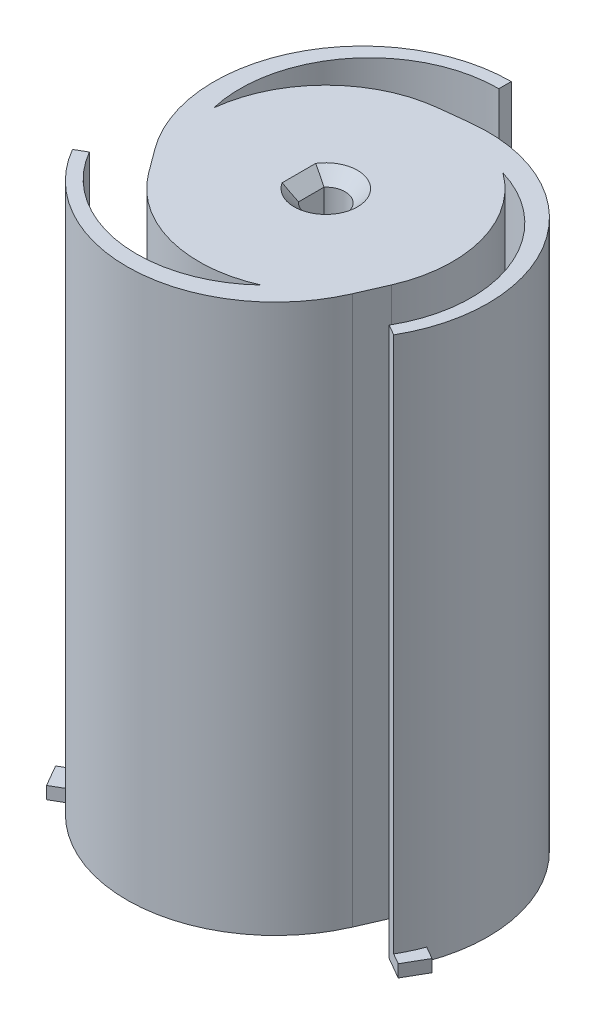
ISO-10303-21;
HEADER;
FILE_DESCRIPTION(('STEP AP214'),'2;1');
FILE_NAME('part.step','',(''),(''),'','','');
FILE_SCHEMA(('AUTOMOTIVE_DESIGN { 1 0 10303 214 1 1 1 1 }'));
ENDSEC;
DATA;
#1=APPLICATION_CONTEXT('core data for automotive mechanical design processes');
#2=APPLICATION_PROTOCOL_DEFINITION('international standard','automotive_design',2000,#1);
#3=PRODUCT_CONTEXT('',#1,'mechanical');
#4=PRODUCT('Part','Part','',(#3));
#5=PRODUCT_RELATED_PRODUCT_CATEGORY('part','',(#4));
#6=PRODUCT_DEFINITION_FORMATION('','',#4);
#7=PRODUCT_DEFINITION_CONTEXT('part definition',#1,'design');
#8=PRODUCT_DEFINITION('design','',#6,#7);
#9=PRODUCT_DEFINITION_SHAPE('','',#8);
#10=(LENGTH_UNIT() NAMED_UNIT(*) SI_UNIT(.MILLI.,.METRE.));
#11=(NAMED_UNIT(*) PLANE_ANGLE_UNIT() SI_UNIT($,.RADIAN.));
#12=(NAMED_UNIT(*) SI_UNIT($,.STERADIAN.) SOLID_ANGLE_UNIT());
#13=UNCERTAINTY_MEASURE_WITH_UNIT(LENGTH_MEASURE(1.E-05),#10,'distance_accuracy_value','');
#14=(GEOMETRIC_REPRESENTATION_CONTEXT(3) GLOBAL_UNCERTAINTY_ASSIGNED_CONTEXT((#13)) GLOBAL_UNIT_ASSIGNED_CONTEXT((#10,
#11,#12)) REPRESENTATION_CONTEXT('',''));
#15=CARTESIAN_POINT('',(0.,0.,0.));
#16=DIRECTION('',(0.,0.,1.));
#17=DIRECTION('',(1.,0.,0.));
#18=AXIS2_PLACEMENT_3D('',#15,#16,#17);
#19=CARTESIAN_POINT('',(1.61039961072153,0.,-1.48990683229814));
#20=DIRECTION('',(0.,1.,0.));
#21=DIRECTION('',(1.,0.,0.));
#22=AXIS2_PLACEMENT_3D('',#19,#20,#21);
#23=PLANE('',#22);
#24=CARTESIAN_POINT('',(0.,0.,0.));
#25=DIRECTION('',(0.,1.,0.));
#26=DIRECTION('',(1.,0.,0.));
#27=AXIS2_PLACEMENT_3D('',#24,#25,#26);
#28=CIRCLE('',#27,20.5);
#29=CARTESIAN_POINT('',(-16.4906340292066,0.,12.1782178217822));
#30=VERTEX_POINT('',#29);
#31=CARTESIAN_POINT('',(8.2545910767858,0.,18.7646403150993));
#32=VERTEX_POINT('',#31);
#33=EDGE_CURVE('E503',#30,#32,#28,.T.);
#34=ORIENTED_EDGE('',*,*,#33,.F.);
#35=DIRECTION('',(-0.594059405940594,0.,-0.80442117215642));
#36=VECTOR('',#35,1.);
#37=CARTESIAN_POINT('',(-16.4906340292066,0.,12.1782178217822));
#38=LINE('',#37,#36);
#39=CARTESIAN_POINT('',(-19.3385847629281,0.,8.32178217821784));
#40=VERTEX_POINT('',#39);
#41=EDGE_CURVE('E368',#30,#40,#38,.T.);
#42=ORIENTED_EDGE('',*,*,#41,.T.);
#43=CARTESIAN_POINT('',(0.,0.,-5.95962732919255));
#44=DIRECTION('',(0.,1.,0.));
#45=DIRECTION('',(0.,0.,-1.));
#46=AXIS2_PLACEMENT_3D('',#43,#44,#45);
#47=CIRCLE('',#46,24.0403726708075);
#48=CARTESIAN_POINT('',(-4.,0.,-29.6648908407274));
#49=VERTEX_POINT('',#48);
#50=EDGE_CURVE('E429',#49,#40,#47,.T.);
#51=ORIENTED_EDGE('',*,*,#50,.F.);
#52=DIRECTION('',(0.,0.,1.));
#53=VECTOR('',#52,1.);
#54=CARTESIAN_POINT('',(-4.,0.,-32.));
#55=LINE('',#54,#53);
#56=CARTESIAN_POINT('',(-4.,0.,-32.));
#57=VERTEX_POINT('',#56);
#58=EDGE_CURVE('E384',#57,#49,#55,.T.);
#59=ORIENTED_EDGE('',*,*,#58,.F.);
#60=DIRECTION('',(-1.,0.,0.));
#61=VECTOR('',#60,1.);
#62=CARTESIAN_POINT('',(0.,0.,-32.));
#63=LINE('',#62,#61);
#64=CARTESIAN_POINT('',(0.,0.,-32.));
#65=VERTEX_POINT('',#64);
#66=EDGE_CURVE('E349',#65,#57,#63,.T.);
#67=ORIENTED_EDGE('',*,*,#66,.F.);
#68=DIRECTION('',(0.,0.,-1.));
#69=VECTOR('',#68,1.);
#70=CARTESIAN_POINT('',(0.,0.,-28.));
#71=LINE('',#70,#69);
#72=CARTESIAN_POINT('',(0.,0.,-28.));
#73=VERTEX_POINT('',#72);
#74=EDGE_CURVE('E428',#73,#65,#71,.T.);
#75=ORIENTED_EDGE('',*,*,#74,.F.);
#76=CARTESIAN_POINT('',(0.,0.,-7.05862068965518));
#77=DIRECTION('',(0.,1.,0.));
#78=DIRECTION('',(0.,0.,-1.));
#79=AXIS2_PLACEMENT_3D('',#76,#77,#78);
#80=CIRCLE('',#79,20.9413793103448);
#81=CARTESIAN_POINT('',(-20.3779507441465,0.,-2.23363458720077));
#82=VERTEX_POINT('',#81);
#83=EDGE_CURVE('E400',#73,#82,#80,.T.);
#84=ORIENTED_EDGE('',*,*,#83,.T.);
#85=CARTESIAN_POINT('',(0.,0.,0.));
#86=DIRECTION('',(0.,1.,0.));
#87=DIRECTION('',(1.,0.,0.));
#88=AXIS2_PLACEMENT_3D('',#85,#86,#87);
#89=CIRCLE('',#88,20.5);
#90=CARTESIAN_POINT('',(-2.30132899188048,0.,-20.3704169046961));
#91=VERTEX_POINT('',#90);
#92=EDGE_CURVE('E471',#91,#82,#89,.T.);
#93=ORIENTED_EDGE('',*,*,#92,.F.);
#94=DIRECTION('',(0.993678873399812,0.,-0.112259950823437));
#95=VECTOR('',#94,1.);
#96=CARTESIAN_POINT('',(-2.30132899188048,0.,-20.3704169046961));
#97=LINE('',#96,#95);
#98=CARTESIAN_POINT('',(2.46241761036678,0.,-20.9085967670433));
#99=VERTEX_POINT('',#98);
#100=EDGE_CURVE('E481',#91,#99,#97,.T.);
#101=ORIENTED_EDGE('',*,*,#100,.T.);
#102=CARTESIAN_POINT('',(5.16118866416876,0.,2.97981366459627));
#103=DIRECTION('',(0.,1.,0.));
#104=DIRECTION('',(0.866025403784439,0.,0.5));
#105=AXIS2_PLACEMENT_3D('',#102,#103,#104);
#106=CIRCLE('',#105,24.0403726708075);
#107=CARTESIAN_POINT('',(27.6905490685623,0.,11.3683438052259));
#108=VERTEX_POINT('',#107);
#109=EDGE_CURVE('E491',#108,#99,#106,.T.);
#110=ORIENTED_EDGE('',*,*,#109,.F.);
#111=DIRECTION('',(-0.866025403784439,0.,-0.5));
#112=VECTOR('',#111,1.);
#113=CARTESIAN_POINT('',(29.712812921102,0.,12.5358983848622));
#114=LINE('',#113,#112);
#115=CARTESIAN_POINT('',(29.712812921102,0.,12.5358983848622));
#116=VERTEX_POINT('',#115);
#117=EDGE_CURVE('E391',#116,#108,#114,.T.);
#118=ORIENTED_EDGE('',*,*,#117,.F.);
#119=DIRECTION('',(0.5,0.,-0.866025403784439));
#120=VECTOR('',#119,1.);
#121=CARTESIAN_POINT('',(27.712812921102,0.,16.));
#122=LINE('',#121,#120);
#123=CARTESIAN_POINT('',(27.712812921102,0.,16.));
#124=VERTEX_POINT('',#123);
#125=EDGE_CURVE('E355',#124,#116,#122,.T.);
#126=ORIENTED_EDGE('',*,*,#125,.F.);
#127=DIRECTION('',(0.866025403784439,0.,0.5));
#128=VECTOR('',#127,1.);
#129=CARTESIAN_POINT('',(24.2487113059643,0.,14.));
#130=LINE('',#129,#128);
#131=CARTESIAN_POINT('',(24.2487113059643,0.,14.));
#132=VERTEX_POINT('',#131);
#133=EDGE_CURVE('E490',#132,#124,#130,.T.);
#134=ORIENTED_EDGE('',*,*,#133,.F.);
#135=CARTESIAN_POINT('',(6.11294483291982,0.,3.52931034482758));
#136=DIRECTION('',(0.,1.,0.));
#137=DIRECTION('',(0.866025403784439,0.,0.5));
#138=AXIS2_PLACEMENT_3D('',#135,#136,#137);
#139=CIRCLE('',#138,20.9413793103448);
#140=CARTESIAN_POINT('',(12.1233596673607,0.,-16.5310057278985));
#141=VERTEX_POINT('',#140);
#142=EDGE_CURVE('E356',#132,#141,#139,.T.);
#143=ORIENTED_EDGE('',*,*,#142,.T.);
#144=CARTESIAN_POINT('',(0.,0.,0.));
#145=DIRECTION('',(0.,1.,0.));
#146=DIRECTION('',(1.,0.,0.));
#147=AXIS2_PLACEMENT_3D('',#144,#145,#146);
#148=CIRCLE('',#147,20.5);
#149=CARTESIAN_POINT('',(18.7919630210871,0.,8.19219908291394));
#150=VERTEX_POINT('',#149);
#151=EDGE_CURVE('E409',#150,#141,#148,.T.);
#152=ORIENTED_EDGE('',*,*,#151,.F.);
#153=DIRECTION('',(-0.399619467459218,0.,0.916681122979857));
#154=VECTOR('',#153,1.);
#155=CARTESIAN_POINT('',(18.7919630210871,0.,8.19219908291394));
#156=LINE('',#155,#154);
#157=CARTESIAN_POINT('',(16.8761671525613,0.,12.5868145888255));
#158=VERTEX_POINT('',#157);
#159=EDGE_CURVE('E424',#150,#158,#156,.T.);
#160=ORIENTED_EDGE('',*,*,#159,.T.);
#161=CARTESIAN_POINT('',(-5.16118866416874,0.,2.97981366459627));
#162=DIRECTION('',(0.,1.,0.));
#163=DIRECTION('',(-0.866025403784439,0.,0.5));
#164=AXIS2_PLACEMENT_3D('',#161,#162,#163);
#165=CIRCLE('',#164,24.0403726708075);
#166=CARTESIAN_POINT('',(-23.6905490685622,0.,18.2965470355014));
#167=VERTEX_POINT('',#166);
#168=EDGE_CURVE('E423',#167,#158,#165,.T.);
#169=ORIENTED_EDGE('',*,*,#168,.F.);
#170=DIRECTION('',(0.866025403784439,0.,-0.5));
#171=VECTOR('',#170,1.);
#172=CARTESIAN_POINT('',(-25.712812921102,0.,19.4641016151377));
#173=LINE('',#172,#171);
#174=CARTESIAN_POINT('',(-25.712812921102,0.,19.4641016151377));
#175=VERTEX_POINT('',#174);
#176=EDGE_CURVE('E506',#175,#167,#173,.T.);
#177=ORIENTED_EDGE('',*,*,#176,.F.);
#178=DIRECTION('',(0.5,0.,0.866025403784439));
#179=VECTOR('',#178,1.);
#180=CARTESIAN_POINT('',(-27.712812921102,0.,16.));
#181=LINE('',#180,#179);
#182=CARTESIAN_POINT('',(-27.712812921102,0.,16.));
#183=VERTEX_POINT('',#182);
#184=EDGE_CURVE('E389',#183,#175,#181,.T.);
#185=ORIENTED_EDGE('',*,*,#184,.F.);
#186=DIRECTION('',(-0.866025403784439,0.,0.5));
#187=VECTOR('',#186,1.);
#188=CARTESIAN_POINT('',(-24.2487113059643,0.,14.));
#189=LINE('',#188,#187);
#190=CARTESIAN_POINT('',(-24.2487113059643,0.,14.));
#191=VERTEX_POINT('',#190);
#192=EDGE_CURVE('E378',#191,#183,#189,.T.);
#193=ORIENTED_EDGE('',*,*,#192,.F.);
#194=CARTESIAN_POINT('',(-6.1129448329198,0.,3.52931034482758));
#195=DIRECTION('',(0.,1.,0.));
#196=DIRECTION('',(-0.866025403784439,0.,0.5));
#197=AXIS2_PLACEMENT_3D('',#194,#195,#196);
#198=CIRCLE('',#197,20.9413793103448);
#199=EDGE_CURVE('E377',#191,#32,#198,.T.);
#200=ORIENTED_EDGE('',*,*,#199,.T.);
#201=EDGE_LOOP('',(#34,#42,#51,#59,#67,#75,#84,#93,#101,#110,#118,#126,#134,#143,#152,#160,#169,
#177,#185,#193,#200));
#202=FACE_BOUND('',#201,.T.);
#203=ADVANCED_FACE('F45',(#202),#23,.F.);
#204=CARTESIAN_POINT('',(0.,0.,0.));
#205=DIRECTION('',(0.,1.,0.));
#206=DIRECTION('',(1.,0.,0.));
#207=AXIS2_PLACEMENT_3D('',#204,#205,#206);
#208=CYLINDRICAL_SURFACE('',#207,20.5);
#209=ORIENTED_EDGE('',*,*,#33,.T.);
#210=DIRECTION('',(0.,1.,0.));
#211=VECTOR('',#210,1.);
#212=CARTESIAN_POINT('',(8.2545910767858,0.,18.7646403150993));
#213=LINE('',#212,#211);
#214=CARTESIAN_POINT('',(8.25459107678579,88.74,18.7646403150993));
#215=VERTEX_POINT('',#214);
#216=EDGE_CURVE('E475',#32,#215,#213,.T.);
#217=ORIENTED_EDGE('',*,*,#216,.T.);
#218=CARTESIAN_POINT('',(0.,88.74,0.));
#219=DIRECTION('',(0.,1.,0.));
#220=DIRECTION('',(0.,0.,1.));
#221=AXIS2_PLACEMENT_3D('',#218,#219,#220);
#222=CIRCLE('',#221,20.5);
#223=CARTESIAN_POINT('',(-16.4906340292066,88.74,12.1782178217822));
#224=VERTEX_POINT('',#223);
#225=EDGE_CURVE('E345',#224,#215,#222,.T.);
#226=ORIENTED_EDGE('',*,*,#225,.F.);
#227=DIRECTION('',(0.,1.,0.));
#228=VECTOR('',#227,1.);
#229=CARTESIAN_POINT('',(-16.4906340292066,0.,12.1782178217822));
#230=LINE('',#229,#228);
#231=EDGE_CURVE('E372',#30,#224,#230,.T.);
#232=ORIENTED_EDGE('',*,*,#231,.F.);
#233=EDGE_LOOP('',(#209,#217,#226,#232));
#234=FACE_BOUND('',#233,.T.);
#235=ADVANCED_FACE('F630',(#234),#208,.T.);
#236=CARTESIAN_POINT('',(-6.1129448329198,0.,3.52931034482758));
#237=DIRECTION('',(0.,1.,0.));
#238=DIRECTION('',(-0.866025403784439,0.,0.5));
#239=AXIS2_PLACEMENT_3D('',#236,#237,#238);
#240=CYLINDRICAL_SURFACE('',#239,20.9413793103448);
#241=ORIENTED_EDGE('',*,*,#199,.F.);
#242=DIRECTION('',(0.,1.,0.));
#243=VECTOR('',#242,1.);
#244=CARTESIAN_POINT('',(-24.2487113059643,0.,14.));
#245=LINE('',#244,#243);
#246=CARTESIAN_POINT('',(-24.2487113059643,88.74,14.));
#247=VERTEX_POINT('',#246);
#248=EDGE_CURVE('E374',#191,#247,#245,.T.);
#249=ORIENTED_EDGE('',*,*,#248,.T.);
#250=CARTESIAN_POINT('',(-6.1129448329198,88.74,3.52931034482758));
#251=DIRECTION('',(0.,-1.,0.));
#252=DIRECTION('',(0.,0.,1.));
#253=AXIS2_PLACEMENT_3D('',#250,#251,#252);
#254=CIRCLE('',#253,20.9413793103449);
#255=EDGE_CURVE('E288',#215,#247,#254,.T.);
#256=ORIENTED_EDGE('',*,*,#255,.F.);
#257=ORIENTED_EDGE('',*,*,#216,.F.);
#258=EDGE_LOOP('',(#241,#249,#256,#257));
#259=FACE_BOUND('',#258,.T.);
#260=ADVANCED_FACE('F622',(#259),#240,.F.);
#261=CARTESIAN_POINT('',(-24.2487113059643,0.,14.));
#262=DIRECTION('',(-0.5,0.,-0.866025403784439));
#263=DIRECTION('',(-0.866025403784439,0.,0.5));
#264=AXIS2_PLACEMENT_3D('',#261,#262,#263);
#265=PLANE('',#264);
#266=ORIENTED_EDGE('',*,*,#192,.T.);
#267=DIRECTION('',(0.,1.,0.));
#268=VECTOR('',#267,1.);
#269=CARTESIAN_POINT('',(-27.712812921102,0.,16.));
#270=LINE('',#269,#268);
#271=CARTESIAN_POINT('',(-27.712812921102,2.,16.));
#272=VERTEX_POINT('',#271);
#273=EDGE_CURVE('E419',#183,#272,#270,.T.);
#274=ORIENTED_EDGE('',*,*,#273,.T.);
#275=DIRECTION('',(-0.866025403784439,0.,0.5));
#276=VECTOR('',#275,1.);
#277=CARTESIAN_POINT('',(-24.2487113059643,2.,14.));
#278=LINE('',#277,#276);
#279=CARTESIAN_POINT('',(-25.9807621135332,2.,15.));
#280=VERTEX_POINT('',#279);
#281=EDGE_CURVE('E373',#280,#272,#278,.T.);
#282=ORIENTED_EDGE('',*,*,#281,.F.);
#283=DIRECTION('',(0.,1.,0.));
#284=VECTOR('',#283,1.);
#285=CARTESIAN_POINT('',(-25.9807621135332,0.,15.));
#286=LINE('',#285,#284);
#287=CARTESIAN_POINT('',(-25.9807621135332,88.74,15.));
#288=VERTEX_POINT('',#287);
#289=EDGE_CURVE('E460',#280,#288,#286,.T.);
#290=ORIENTED_EDGE('',*,*,#289,.T.);
#291=DIRECTION('',(-0.866025403784442,0.,0.499999999999995));
#292=VECTOR('',#291,1.);
#293=CARTESIAN_POINT('',(-24.2487113059643,88.74,14.));
#294=LINE('',#293,#292);
#295=EDGE_CURVE('E293',#247,#288,#294,.T.);
#296=ORIENTED_EDGE('',*,*,#295,.F.);
#297=ORIENTED_EDGE('',*,*,#248,.F.);
#298=EDGE_LOOP('',(#266,#274,#282,#290,#296,#297));
#299=FACE_BOUND('',#298,.T.);
#300=ADVANCED_FACE('F586',(#299),#265,.T.);
#301=CARTESIAN_POINT('',(-5.16118866416874,0.,2.97981366459627));
#302=DIRECTION('',(0.,1.,0.));
#303=DIRECTION('',(-0.866025403784439,0.,0.5));
#304=AXIS2_PLACEMENT_3D('',#301,#302,#303);
#305=CYLINDRICAL_SURFACE('',#304,24.0403726708075);
#306=DIRECTION('',(0.,-1.,0.));
#307=VECTOR('',#306,1.);
#308=CARTESIAN_POINT('',(-23.6905490685622,0.,18.2965470355014));
#309=LINE('',#308,#307);
#310=CARTESIAN_POINT('',(-23.6905490685622,2.,18.2965470355014));
#311=VERTEX_POINT('',#310);
#312=EDGE_CURVE('E443',#311,#167,#309,.T.);
#313=ORIENTED_EDGE('',*,*,#312,.T.);
#314=ORIENTED_EDGE('',*,*,#168,.T.);
#315=DIRECTION('',(0.,1.,0.));
#316=VECTOR('',#315,1.);
#317=CARTESIAN_POINT('',(16.8761671525613,0.,12.5868145888255));
#318=LINE('',#317,#316);
#319=CARTESIAN_POINT('',(16.8761671525613,88.74,12.5868145888255));
#320=VERTEX_POINT('',#319);
#321=EDGE_CURVE('E420',#158,#320,#318,.T.);
#322=ORIENTED_EDGE('',*,*,#321,.T.);
#323=CARTESIAN_POINT('',(-5.16118866416874,88.74,2.97981366459627));
#324=DIRECTION('',(0.,1.,0.));
#325=DIRECTION('',(0.,0.,1.));
#326=AXIS2_PLACEMENT_3D('',#323,#324,#325);
#327=CIRCLE('',#326,24.0403726708075);
#328=EDGE_CURVE('E297',#288,#320,#327,.T.);
#329=ORIENTED_EDGE('',*,*,#328,.F.);
#330=ORIENTED_EDGE('',*,*,#289,.F.);
#331=CARTESIAN_POINT('',(-5.16118866416874,2.,2.97981366459627));
#332=DIRECTION('',(0.,1.,0.));
#333=DIRECTION('',(-0.866025403784439,0.,0.5));
#334=AXIS2_PLACEMENT_3D('',#331,#332,#333);
#335=CIRCLE('',#334,24.0403726708075);
#336=EDGE_CURVE('E454',#280,#311,#335,.T.);
#337=ORIENTED_EDGE('',*,*,#336,.T.);
#338=EDGE_LOOP('',(#313,#314,#322,#329,#330,#337));
#339=FACE_BOUND('',#338,.T.);
#340=ADVANCED_FACE('F582',(#339),#305,.T.);
#341=CARTESIAN_POINT('',(16.8761671525613,0.,12.5868145888255));
#342=DIRECTION('',(0.916681122979857,0.,0.399619467459218));
#343=DIRECTION('',(0.,-1.,0.));
#344=AXIS2_PLACEMENT_3D('',#341,#342,#343);
#345=PLANE('',#344);
#346=ORIENTED_EDGE('',*,*,#159,.F.);
#347=DIRECTION('',(0.,1.,0.));
#348=VECTOR('',#347,1.);
#349=CARTESIAN_POINT('',(18.7919630210871,0.,8.19219908291394));
#350=LINE('',#349,#348);
#351=CARTESIAN_POINT('',(18.7919630210871,88.74,8.19219908291394));
#352=VERTEX_POINT('',#351);
#353=EDGE_CURVE('E412',#150,#352,#350,.T.);
#354=ORIENTED_EDGE('',*,*,#353,.T.);
#355=DIRECTION('',(0.399619467459218,0.,-0.916681122979856));
#356=VECTOR('',#355,1.);
#357=CARTESIAN_POINT('',(16.8761671525613,88.74,12.5868145888255));
#358=LINE('',#357,#356);
#359=EDGE_CURVE('E301',#320,#352,#358,.T.);
#360=ORIENTED_EDGE('',*,*,#359,.F.);
#361=ORIENTED_EDGE('',*,*,#321,.F.);
#362=EDGE_LOOP('',(#346,#354,#360,#361));
#363=FACE_BOUND('',#362,.T.);
#364=ADVANCED_FACE('F585',(#363),#345,.T.);
#365=CARTESIAN_POINT('',(0.,0.,0.));
#366=DIRECTION('',(0.,1.,0.));
#367=DIRECTION('',(1.,0.,0.));
#368=AXIS2_PLACEMENT_3D('',#365,#366,#367);
#369=CYLINDRICAL_SURFACE('',#368,20.5);
#370=ORIENTED_EDGE('',*,*,#151,.T.);
#371=DIRECTION('',(0.,1.,0.));
#372=VECTOR('',#371,1.);
#373=CARTESIAN_POINT('',(12.1233596673607,0.,-16.5310057278985));
#374=LINE('',#373,#372);
#375=CARTESIAN_POINT('',(12.1233596673607,88.74,-16.5310057278985));
#376=VERTEX_POINT('',#375);
#377=EDGE_CURVE('E360',#141,#376,#374,.T.);
#378=ORIENTED_EDGE('',*,*,#377,.T.);
#379=CARTESIAN_POINT('',(0.,88.74,0.));
#380=DIRECTION('',(0.,1.,0.));
#381=DIRECTION('',(0.,0.,1.));
#382=AXIS2_PLACEMENT_3D('',#379,#380,#381);
#383=CIRCLE('',#382,20.5);
#384=EDGE_CURVE('E305',#352,#376,#383,.T.);
#385=ORIENTED_EDGE('',*,*,#384,.F.);
#386=ORIENTED_EDGE('',*,*,#353,.F.);
#387=EDGE_LOOP('',(#370,#378,#385,#386));
#388=FACE_BOUND('',#387,.T.);
#389=ADVANCED_FACE('F612',(#388),#369,.T.);
#390=CARTESIAN_POINT('',(6.11294483291982,0.,3.52931034482758));
#391=DIRECTION('',(0.,1.,0.));
#392=DIRECTION('',(0.866025403784439,0.,0.5));
#393=AXIS2_PLACEMENT_3D('',#390,#391,#392);
#394=CYLINDRICAL_SURFACE('',#393,20.9413793103448);
#395=ORIENTED_EDGE('',*,*,#142,.F.);
#396=DIRECTION('',(0.,1.,0.));
#397=VECTOR('',#396,1.);
#398=CARTESIAN_POINT('',(24.2487113059643,0.,14.));
#399=LINE('',#398,#397);
#400=CARTESIAN_POINT('',(24.2487113059643,88.74,14.));
#401=VERTEX_POINT('',#400);
#402=EDGE_CURVE('E361',#132,#401,#399,.T.);
#403=ORIENTED_EDGE('',*,*,#402,.T.);
#404=CARTESIAN_POINT('',(6.11294483291982,88.74,3.52931034482758));
#405=DIRECTION('',(0.,-1.,0.));
#406=DIRECTION('',(0.,0.,1.));
#407=AXIS2_PLACEMENT_3D('',#404,#405,#406);
#408=CIRCLE('',#407,20.9413793103448);
#409=EDGE_CURVE('E309',#376,#401,#408,.T.);
#410=ORIENTED_EDGE('',*,*,#409,.F.);
#411=ORIENTED_EDGE('',*,*,#377,.F.);
#412=EDGE_LOOP('',(#395,#403,#410,#411));
#413=FACE_BOUND('',#412,.T.);
#414=ADVANCED_FACE('F608',(#413),#394,.F.);
#415=CARTESIAN_POINT('',(24.2487113059643,0.,14.));
#416=DIRECTION('',(-0.5,0.,0.866025403784439));
#417=DIRECTION('',(0.,1.,0.));
#418=AXIS2_PLACEMENT_3D('',#415,#416,#417);
#419=PLANE('',#418);
#420=ORIENTED_EDGE('',*,*,#133,.T.);
#421=DIRECTION('',(0.,1.,0.));
#422=VECTOR('',#421,1.);
#423=CARTESIAN_POINT('',(27.712812921102,0.,16.));
#424=LINE('',#423,#422);
#425=CARTESIAN_POINT('',(27.712812921102,2.,16.));
#426=VERTEX_POINT('',#425);
#427=EDGE_CURVE('E396',#124,#426,#424,.T.);
#428=ORIENTED_EDGE('',*,*,#427,.T.);
#429=DIRECTION('',(0.866025403784439,0.,0.5));
#430=VECTOR('',#429,1.);
#431=CARTESIAN_POINT('',(24.2487113059643,2.,14.));
#432=LINE('',#431,#430);
#433=CARTESIAN_POINT('',(25.9807621135332,2.,15.));
#434=VERTEX_POINT('',#433);
#435=EDGE_CURVE('E466',#434,#426,#432,.T.);
#436=ORIENTED_EDGE('',*,*,#435,.F.);
#437=DIRECTION('',(0.,1.,0.));
#438=VECTOR('',#437,1.);
#439=CARTESIAN_POINT('',(25.9807621135332,0.,15.));
#440=LINE('',#439,#438);
#441=CARTESIAN_POINT('',(25.9807621135332,88.74,15.));
#442=VERTEX_POINT('',#441);
#443=EDGE_CURVE('E487',#434,#442,#440,.T.);
#444=ORIENTED_EDGE('',*,*,#443,.T.);
#445=DIRECTION('',(0.866025403784442,0.,0.499999999999995));
#446=VECTOR('',#445,1.);
#447=CARTESIAN_POINT('',(24.2487113059643,88.74,14.));
#448=LINE('',#447,#446);
#449=EDGE_CURVE('E313',#401,#442,#448,.T.);
#450=ORIENTED_EDGE('',*,*,#449,.F.);
#451=ORIENTED_EDGE('',*,*,#402,.F.);
#452=EDGE_LOOP('',(#420,#428,#436,#444,#450,#451));
#453=FACE_BOUND('',#452,.T.);
#454=ADVANCED_FACE('F611',(#453),#419,.T.);
#455=CARTESIAN_POINT('',(5.16118866416876,0.,2.97981366459627));
#456=DIRECTION('',(0.,1.,0.));
#457=DIRECTION('',(0.866025403784439,0.,0.5));
#458=AXIS2_PLACEMENT_3D('',#455,#456,#457);
#459=CYLINDRICAL_SURFACE('',#458,24.0403726708075);
#460=DIRECTION('',(0.,-1.,0.));
#461=VECTOR('',#460,1.);
#462=CARTESIAN_POINT('',(27.6905490685623,0.,11.3683438052259));
#463=LINE('',#462,#461);
#464=CARTESIAN_POINT('',(27.6905490685623,2.,11.3683438052259));
#465=VERTEX_POINT('',#464);
#466=EDGE_CURVE('E395',#465,#108,#463,.T.);
#467=ORIENTED_EDGE('',*,*,#466,.T.);
#468=ORIENTED_EDGE('',*,*,#109,.T.);
#469=DIRECTION('',(0.,1.,0.));
#470=VECTOR('',#469,1.);
#471=CARTESIAN_POINT('',(2.46241761036678,0.,-20.9085967670433));
#472=LINE('',#471,#470);
#473=CARTESIAN_POINT('',(2.46241761036679,88.74,-20.9085967670433));
#474=VERTEX_POINT('',#473);
#475=EDGE_CURVE('E485',#99,#474,#472,.T.);
#476=ORIENTED_EDGE('',*,*,#475,.T.);
#477=CARTESIAN_POINT('',(5.16118866416876,88.74,2.97981366459627));
#478=DIRECTION('',(0.,1.,0.));
#479=DIRECTION('',(0.,0.,1.));
#480=AXIS2_PLACEMENT_3D('',#477,#478,#479);
#481=CIRCLE('',#480,24.0403726708075);
#482=EDGE_CURVE('E317',#442,#474,#481,.T.);
#483=ORIENTED_EDGE('',*,*,#482,.F.);
#484=ORIENTED_EDGE('',*,*,#443,.F.);
#485=CARTESIAN_POINT('',(5.16118866416876,2.,2.97981366459627));
#486=DIRECTION('',(0.,1.,0.));
#487=DIRECTION('',(0.866025403784439,0.,0.5));
#488=AXIS2_PLACEMENT_3D('',#485,#486,#487);
#489=CIRCLE('',#488,24.0403726708075);
#490=EDGE_CURVE('E434',#434,#465,#489,.T.);
#491=ORIENTED_EDGE('',*,*,#490,.T.);
#492=EDGE_LOOP('',(#467,#468,#476,#483,#484,#491));
#493=FACE_BOUND('',#492,.T.);
#494=ADVANCED_FACE('F606',(#493),#459,.T.);
#495=CARTESIAN_POINT('',(2.46241761036678,0.,-20.9085967670433));
#496=DIRECTION('',(-0.112259950823437,0.,-0.993678873399812));
#497=DIRECTION('',(-0.993678873399812,0.,0.112259950823437));
#498=AXIS2_PLACEMENT_3D('',#495,#496,#497);
#499=PLANE('',#498);
#500=ORIENTED_EDGE('',*,*,#100,.F.);
#501=DIRECTION('',(0.,1.,0.));
#502=VECTOR('',#501,1.);
#503=CARTESIAN_POINT('',(-2.30132899188048,0.,-20.3704169046961));
#504=LINE('',#503,#502);
#505=CARTESIAN_POINT('',(-2.30132899188048,88.74,-20.3704169046961));
#506=VERTEX_POINT('',#505);
#507=EDGE_CURVE('E486',#91,#506,#504,.T.);
#508=ORIENTED_EDGE('',*,*,#507,.T.);
#509=DIRECTION('',(-0.993678873399811,0.,0.112259950823444));
#510=VECTOR('',#509,1.);
#511=CARTESIAN_POINT('',(2.46241761036678,88.74,-20.9085967670433));
#512=LINE('',#511,#510);
#513=EDGE_CURVE('E321',#474,#506,#512,.T.);
#514=ORIENTED_EDGE('',*,*,#513,.F.);
#515=ORIENTED_EDGE('',*,*,#475,.F.);
#516=EDGE_LOOP('',(#500,#508,#514,#515));
#517=FACE_BOUND('',#516,.T.);
#518=ADVANCED_FACE('F602',(#517),#499,.T.);
#519=CARTESIAN_POINT('',(0.,0.,0.));
#520=DIRECTION('',(0.,1.,0.));
#521=DIRECTION('',(1.,0.,0.));
#522=AXIS2_PLACEMENT_3D('',#519,#520,#521);
#523=CYLINDRICAL_SURFACE('',#522,20.5);
#524=ORIENTED_EDGE('',*,*,#92,.T.);
#525=DIRECTION('',(0.,1.,0.));
#526=VECTOR('',#525,1.);
#527=CARTESIAN_POINT('',(-20.3779507441465,0.,-2.23363458720077));
#528=LINE('',#527,#526);
#529=CARTESIAN_POINT('',(-20.3779507441465,88.74,-2.23363458720077));
#530=VERTEX_POINT('',#529);
#531=EDGE_CURVE('E404',#82,#530,#528,.T.);
#532=ORIENTED_EDGE('',*,*,#531,.T.);
#533=CARTESIAN_POINT('',(0.,88.74,0.));
#534=DIRECTION('',(0.,1.,0.));
#535=DIRECTION('',(0.,0.,1.));
#536=AXIS2_PLACEMENT_3D('',#533,#534,#535);
#537=CIRCLE('',#536,20.5);
#538=EDGE_CURVE('E325',#506,#530,#537,.T.);
#539=ORIENTED_EDGE('',*,*,#538,.F.);
#540=ORIENTED_EDGE('',*,*,#507,.F.);
#541=EDGE_LOOP('',(#524,#532,#539,#540));
#542=FACE_BOUND('',#541,.T.);
#543=ADVANCED_FACE('F605',(#542),#523,.T.);
#544=CARTESIAN_POINT('',(0.,0.,-7.05862068965518));
#545=DIRECTION('',(0.,1.,0.));
#546=DIRECTION('',(0.,0.,-1.));
#547=AXIS2_PLACEMENT_3D('',#544,#545,#546);
#548=CYLINDRICAL_SURFACE('',#547,20.9413793103448);
#549=ORIENTED_EDGE('',*,*,#83,.F.);
#550=DIRECTION('',(0.,1.,0.));
#551=VECTOR('',#550,1.);
#552=CARTESIAN_POINT('',(0.,0.,-28.));
#553=LINE('',#552,#551);
#554=CARTESIAN_POINT('',(0.,88.74,-28.));
#555=VERTEX_POINT('',#554);
#556=EDGE_CURVE('E405',#73,#555,#553,.T.);
#557=ORIENTED_EDGE('',*,*,#556,.T.);
#558=CARTESIAN_POINT('',(0.,88.74,-7.05862068965518));
#559=DIRECTION('',(0.,-1.,0.));
#560=DIRECTION('',(0.,0.,1.));
#561=AXIS2_PLACEMENT_3D('',#558,#559,#560);
#562=CIRCLE('',#561,20.9413793103448);
#563=EDGE_CURVE('E329',#530,#555,#562,.T.);
#564=ORIENTED_EDGE('',*,*,#563,.F.);
#565=ORIENTED_EDGE('',*,*,#531,.F.);
#566=EDGE_LOOP('',(#549,#557,#564,#565));
#567=FACE_BOUND('',#566,.T.);
#568=ADVANCED_FACE('F624',(#567),#548,.F.);
#569=CARTESIAN_POINT('',(0.,0.,-28.));
#570=DIRECTION('',(1.,0.,0.));
#571=DIRECTION('',(0.,0.,1.));
#572=AXIS2_PLACEMENT_3D('',#569,#570,#571);
#573=PLANE('',#572);
#574=ORIENTED_EDGE('',*,*,#74,.T.);
#575=DIRECTION('',(0.,1.,0.));
#576=VECTOR('',#575,1.);
#577=CARTESIAN_POINT('',(0.,0.,-32.));
#578=LINE('',#577,#576);
#579=CARTESIAN_POINT('',(0.,2.,-32.));
#580=VERTEX_POINT('',#579);
#581=EDGE_CURVE('E366',#65,#580,#578,.T.);
#582=ORIENTED_EDGE('',*,*,#581,.T.);
#583=DIRECTION('',(0.,0.,-1.));
#584=VECTOR('',#583,1.);
#585=CARTESIAN_POINT('',(0.,2.,-28.));
#586=LINE('',#585,#584);
#587=CARTESIAN_POINT('',(0.,2.,-30.));
#588=VERTEX_POINT('',#587);
#589=EDGE_CURVE('E447',#588,#580,#586,.T.);
#590=ORIENTED_EDGE('',*,*,#589,.F.);
#591=DIRECTION('',(0.,1.,0.));
#592=VECTOR('',#591,1.);
#593=CARTESIAN_POINT('',(0.,0.,-30.));
#594=LINE('',#593,#592);
#595=CARTESIAN_POINT('',(0.,88.74,-30.));
#596=VERTEX_POINT('',#595);
#597=EDGE_CURVE('E425',#588,#596,#594,.T.);
#598=ORIENTED_EDGE('',*,*,#597,.T.);
#599=DIRECTION('',(0.,0.,-1.));
#600=VECTOR('',#599,1.);
#601=CARTESIAN_POINT('',(0.,88.74,-28.));
#602=LINE('',#601,#600);
#603=EDGE_CURVE('E333',#555,#596,#602,.T.);
#604=ORIENTED_EDGE('',*,*,#603,.F.);
#605=ORIENTED_EDGE('',*,*,#556,.F.);
#606=EDGE_LOOP('',(#574,#582,#590,#598,#604,#605));
#607=FACE_BOUND('',#606,.T.);
#608=ADVANCED_FACE('F575',(#607),#573,.T.);
#609=CARTESIAN_POINT('',(0.,0.,-5.95962732919255));
#610=DIRECTION('',(0.,1.,0.));
#611=DIRECTION('',(0.,0.,-1.));
#612=AXIS2_PLACEMENT_3D('',#609,#610,#611);
#613=CYLINDRICAL_SURFACE('',#612,24.0403726708075);
#614=DIRECTION('',(0.,-1.,0.));
#615=VECTOR('',#614,1.);
#616=CARTESIAN_POINT('',(-4.,0.,-29.6648908407274));
#617=LINE('',#616,#615);
#618=CARTESIAN_POINT('',(-4.,2.,-29.6648908407274));
#619=VERTEX_POINT('',#618);
#620=EDGE_CURVE('E379',#619,#49,#617,.T.);
#621=ORIENTED_EDGE('',*,*,#620,.T.);
#622=ORIENTED_EDGE('',*,*,#50,.T.);
#623=DIRECTION('',(0.,1.,0.));
#624=VECTOR('',#623,1.);
#625=CARTESIAN_POINT('',(-19.3385847629281,0.,8.32178217821784));
#626=LINE('',#625,#624);
#627=CARTESIAN_POINT('',(-19.3385847629281,88.74,8.32178217821782));
#628=VERTEX_POINT('',#627);
#629=EDGE_CURVE('E463',#40,#628,#626,.T.);
#630=ORIENTED_EDGE('',*,*,#629,.T.);
#631=CARTESIAN_POINT('',(0.,88.74,-5.95962732919255));
#632=DIRECTION('',(0.,1.,0.));
#633=DIRECTION('',(0.,0.,1.));
#634=AXIS2_PLACEMENT_3D('',#631,#632,#633);
#635=CIRCLE('',#634,24.0403726708075);
#636=EDGE_CURVE('E337',#596,#628,#635,.T.);
#637=ORIENTED_EDGE('',*,*,#636,.F.);
#638=ORIENTED_EDGE('',*,*,#597,.F.);
#639=CARTESIAN_POINT('',(0.,2.,-5.95962732919255));
#640=DIRECTION('',(0.,1.,0.));
#641=DIRECTION('',(0.,0.,-1.));
#642=AXIS2_PLACEMENT_3D('',#639,#640,#641);
#643=CIRCLE('',#642,24.0403726708075);
#644=EDGE_CURVE('E455',#588,#619,#643,.T.);
#645=ORIENTED_EDGE('',*,*,#644,.T.);
#646=EDGE_LOOP('',(#621,#622,#630,#637,#638,#645));
#647=FACE_BOUND('',#646,.T.);
#648=ADVANCED_FACE('F571',(#647),#613,.T.);
#649=CARTESIAN_POINT('',(-19.3385847629281,0.,8.32178217821785));
#650=DIRECTION('',(-0.80442117215642,0.,0.594059405940594));
#651=DIRECTION('',(0.,1.,0.));
#652=AXIS2_PLACEMENT_3D('',#649,#650,#651);
#653=PLANE('',#652);
#654=ORIENTED_EDGE('',*,*,#41,.F.);
#655=ORIENTED_EDGE('',*,*,#231,.T.);
#656=DIRECTION('',(0.594059405940595,0.,0.804421172156419));
#657=VECTOR('',#656,1.);
#658=CARTESIAN_POINT('',(-19.3385847629281,88.74,8.32178217821784));
#659=LINE('',#658,#657);
#660=EDGE_CURVE('E341',#628,#224,#659,.T.);
#661=ORIENTED_EDGE('',*,*,#660,.F.);
#662=ORIENTED_EDGE('',*,*,#629,.F.);
#663=EDGE_LOOP('',(#654,#655,#661,#662));
#664=FACE_BOUND('',#663,.T.);
#665=ADVANCED_FACE('F574',(#664),#653,.T.);
#666=CARTESIAN_POINT('',(-25.7016809948321,2.,17.2320508075689));
#667=DIRECTION('',(0.,-1.,0.));
#668=DIRECTION('',(0.,0.,-1.));
#669=AXIS2_PLACEMENT_3D('',#666,#667,#668);
#670=PLANE('',#669);
#671=DIRECTION('',(0.5,0.,0.866025403784439));
#672=VECTOR('',#671,1.);
#673=CARTESIAN_POINT('',(-27.712812921102,2.,16.));
#674=LINE('',#673,#672);
#675=CARTESIAN_POINT('',(-25.712812921102,2.,19.4641016151377));
#676=VERTEX_POINT('',#675);
#677=EDGE_CURVE('E416',#272,#676,#674,.T.);
#678=ORIENTED_EDGE('',*,*,#677,.T.);
#679=DIRECTION('',(0.866025403784439,0.,-0.5));
#680=VECTOR('',#679,1.);
#681=CARTESIAN_POINT('',(-25.712812921102,2.,19.4641016151377));
#682=LINE('',#681,#680);
#683=EDGE_CURVE('E390',#676,#311,#682,.T.);
#684=ORIENTED_EDGE('',*,*,#683,.T.);
#685=ORIENTED_EDGE('',*,*,#336,.F.);
#686=ORIENTED_EDGE('',*,*,#281,.T.);
#687=EDGE_LOOP('',(#678,#684,#685,#686));
#688=FACE_BOUND('',#687,.T.);
#689=ADVANCED_FACE('F577',(#688),#670,.F.);
#690=CARTESIAN_POINT('',(-27.712812921102,0.,16.));
#691=DIRECTION('',(-0.866025403784439,0.,0.5));
#692=DIRECTION('',(0.,1.,0.));
#693=AXIS2_PLACEMENT_3D('',#690,#691,#692);
#694=PLANE('',#693);
#695=ORIENTED_EDGE('',*,*,#184,.T.);
#696=DIRECTION('',(0.,1.,0.));
#697=VECTOR('',#696,1.);
#698=CARTESIAN_POINT('',(-25.712812921102,0.,19.4641016151377));
#699=LINE('',#698,#697);
#700=EDGE_CURVE('E385',#175,#676,#699,.T.);
#701=ORIENTED_EDGE('',*,*,#700,.T.);
#702=ORIENTED_EDGE('',*,*,#677,.F.);
#703=ORIENTED_EDGE('',*,*,#273,.F.);
#704=EDGE_LOOP('',(#695,#701,#702,#703));
#705=FACE_BOUND('',#704,.T.);
#706=ADVANCED_FACE('F580',(#705),#694,.T.);
#707=CARTESIAN_POINT('',(-25.712812921102,0.,19.4641016151377));
#708=DIRECTION('',(0.5,0.,0.866025403784439));
#709=DIRECTION('',(0.,-1.,0.));
#710=AXIS2_PLACEMENT_3D('',#707,#708,#709);
#711=PLANE('',#710);
#712=ORIENTED_EDGE('',*,*,#176,.T.);
#713=ORIENTED_EDGE('',*,*,#312,.F.);
#714=ORIENTED_EDGE('',*,*,#683,.F.);
#715=ORIENTED_EDGE('',*,*,#700,.F.);
#716=EDGE_LOOP('',(#712,#713,#714,#715));
#717=FACE_BOUND('',#716,.T.);
#718=ADVANCED_FACE('F592',(#717),#711,.T.);
#719=CARTESIAN_POINT('',(27.8467875173176,2.,13.684171902613));
#720=DIRECTION('',(0.,-1.,0.));
#721=DIRECTION('',(0.,0.,-1.));
#722=AXIS2_PLACEMENT_3D('',#719,#720,#721);
#723=PLANE('',#722);
#724=DIRECTION('',(-0.866025403784439,0.,-0.5));
#725=VECTOR('',#724,1.);
#726=CARTESIAN_POINT('',(29.712812921102,2.,12.5358983848622));
#727=LINE('',#726,#725);
#728=CARTESIAN_POINT('',(29.712812921102,2.,12.5358983848622));
#729=VERTEX_POINT('',#728);
#730=EDGE_CURVE('E430',#729,#465,#727,.T.);
#731=ORIENTED_EDGE('',*,*,#730,.T.);
#732=ORIENTED_EDGE('',*,*,#490,.F.);
#733=ORIENTED_EDGE('',*,*,#435,.T.);
#734=DIRECTION('',(0.5,0.,-0.866025403784439));
#735=VECTOR('',#734,1.);
#736=CARTESIAN_POINT('',(27.712812921102,2.,16.));
#737=LINE('',#736,#735);
#738=EDGE_CURVE('E354',#426,#729,#737,.T.);
#739=ORIENTED_EDGE('',*,*,#738,.T.);
#740=EDGE_LOOP('',(#731,#732,#733,#739));
#741=FACE_BOUND('',#740,.T.);
#742=ADVANCED_FACE('F588',(#741),#723,.F.);
#743=CARTESIAN_POINT('',(29.712812921102,0.,12.5358983848622));
#744=DIRECTION('',(0.5,0.,-0.866025403784439));
#745=DIRECTION('',(0.,-1.,0.));
#746=AXIS2_PLACEMENT_3D('',#743,#744,#745);
#747=PLANE('',#746);
#748=ORIENTED_EDGE('',*,*,#117,.T.);
#749=ORIENTED_EDGE('',*,*,#466,.F.);
#750=ORIENTED_EDGE('',*,*,#730,.F.);
#751=DIRECTION('',(0.,1.,0.));
#752=VECTOR('',#751,1.);
#753=CARTESIAN_POINT('',(29.712812921102,0.,12.5358983848622));
#754=LINE('',#753,#752);
#755=EDGE_CURVE('E350',#116,#729,#754,.T.);
#756=ORIENTED_EDGE('',*,*,#755,.F.);
#757=EDGE_LOOP('',(#748,#749,#750,#756));
#758=FACE_BOUND('',#757,.T.);
#759=ADVANCED_FACE('F591',(#758),#747,.T.);
#760=CARTESIAN_POINT('',(27.712812921102,0.,16.));
#761=DIRECTION('',(0.866025403784439,0.,0.5));
#762=DIRECTION('',(0.,-1.,0.));
#763=AXIS2_PLACEMENT_3D('',#760,#761,#762);
#764=PLANE('',#763);
#765=ORIENTED_EDGE('',*,*,#125,.T.);
#766=ORIENTED_EDGE('',*,*,#755,.T.);
#767=ORIENTED_EDGE('',*,*,#738,.F.);
#768=ORIENTED_EDGE('',*,*,#427,.F.);
#769=EDGE_LOOP('',(#765,#766,#767,#768));
#770=FACE_BOUND('',#769,.T.);
#771=ADVANCED_FACE('F569',(#770),#764,.T.);
#772=CARTESIAN_POINT('',(-2.,2.,-30.8324454203637));
#773=DIRECTION('',(0.,-1.,0.));
#774=DIRECTION('',(0.,0.,-1.));
#775=AXIS2_PLACEMENT_3D('',#772,#773,#774);
#776=PLANE('',#775);
#777=DIRECTION('',(0.,0.,1.));
#778=VECTOR('',#777,1.);
#779=CARTESIAN_POINT('',(-4.,2.,-32.));
#780=LINE('',#779,#778);
#781=CARTESIAN_POINT('',(-4.,2.,-32.));
#782=VERTEX_POINT('',#781);
#783=EDGE_CURVE('E383',#782,#619,#780,.T.);
#784=ORIENTED_EDGE('',*,*,#783,.T.);
#785=ORIENTED_EDGE('',*,*,#644,.F.);
#786=ORIENTED_EDGE('',*,*,#589,.T.);
#787=DIRECTION('',(-1.,0.,0.));
#788=VECTOR('',#787,1.);
#789=CARTESIAN_POINT('',(0.,2.,-32.));
#790=LINE('',#789,#788);
#791=EDGE_CURVE('E362',#580,#782,#790,.T.);
#792=ORIENTED_EDGE('',*,*,#791,.T.);
#793=EDGE_LOOP('',(#784,#785,#786,#792));
#794=FACE_BOUND('',#793,.T.);
#795=ADVANCED_FACE('F564',(#794),#776,.F.);
#796=CARTESIAN_POINT('',(-4.,0.,-32.));
#797=DIRECTION('',(-1.,0.,0.));
#798=DIRECTION('',(0.,0.,1.));
#799=AXIS2_PLACEMENT_3D('',#796,#797,#798);
#800=PLANE('',#799);
#801=ORIENTED_EDGE('',*,*,#58,.T.);
#802=ORIENTED_EDGE('',*,*,#620,.F.);
#803=ORIENTED_EDGE('',*,*,#783,.F.);
#804=DIRECTION('',(0.,1.,0.));
#805=VECTOR('',#804,1.);
#806=CARTESIAN_POINT('',(-4.,0.,-32.));
#807=LINE('',#806,#805);
#808=EDGE_CURVE('E367',#57,#782,#807,.T.);
#809=ORIENTED_EDGE('',*,*,#808,.F.);
#810=EDGE_LOOP('',(#801,#802,#803,#809));
#811=FACE_BOUND('',#810,.T.);
#812=ADVANCED_FACE('F568',(#811),#800,.T.);
#813=CARTESIAN_POINT('',(0.,0.,-32.));
#814=DIRECTION('',(0.,0.,-1.));
#815=DIRECTION('',(-1.,0.,0.));
#816=AXIS2_PLACEMENT_3D('',#813,#814,#815);
#817=PLANE('',#816);
#818=ORIENTED_EDGE('',*,*,#66,.T.);
#819=ORIENTED_EDGE('',*,*,#808,.T.);
#820=ORIENTED_EDGE('',*,*,#791,.F.);
#821=ORIENTED_EDGE('',*,*,#581,.F.);
#822=EDGE_LOOP('',(#818,#819,#820,#821));
#823=FACE_BOUND('',#822,.T.);
#824=ADVANCED_FACE('F596',(#823),#817,.T.);
#825=CARTESIAN_POINT('',(-6.1129448329198,88.74,3.52931034482758));
#826=DIRECTION('',(0.,1.,0.));
#827=DIRECTION('',(0.,0.,1.));
#828=AXIS2_PLACEMENT_3D('',#825,#826,#827);
#829=PLANE('',#828);
#830=CARTESIAN_POINT('',(0.,88.74,0.));
#831=DIRECTION('',(0.,1.,0.));
#832=DIRECTION('',(0.,0.,1.));
#833=AXIS2_PLACEMENT_3D('',#830,#831,#832);
#834=CIRCLE('',#833,5.12500000000007);
#835=CARTESIAN_POINT('',(-4.35000000000007,88.74,-2.70982010473023));
#836=VERTEX_POINT('',#835);
#837=CARTESIAN_POINT('',(-4.35000000000007,88.74,2.70982010473023));
#838=VERTEX_POINT('',#837);
#839=EDGE_CURVE('E68',#836,#838,#834,.F.);
#840=ORIENTED_EDGE('',*,*,#839,.T.);
#841=DIRECTION('',(0.,0.,-1.));
#842=VECTOR('',#841,1.);
#843=CARTESIAN_POINT('',(-4.35000000000007,88.74,-2.05988470551145));
#844=LINE('',#843,#842);
#845=EDGE_CURVE('E61',#838,#836,#844,.T.);
#846=ORIENTED_EDGE('',*,*,#845,.T.);
#847=EDGE_LOOP('',(#840,#846));
#848=FACE_BOUND('',#847,.T.);
#849=ORIENTED_EDGE('',*,*,#255,.T.);
#850=ORIENTED_EDGE('',*,*,#295,.T.);
#851=ORIENTED_EDGE('',*,*,#328,.T.);
#852=ORIENTED_EDGE('',*,*,#359,.T.);
#853=ORIENTED_EDGE('',*,*,#384,.T.);
#854=ORIENTED_EDGE('',*,*,#409,.T.);
#855=ORIENTED_EDGE('',*,*,#449,.T.);
#856=ORIENTED_EDGE('',*,*,#482,.T.);
#857=ORIENTED_EDGE('',*,*,#513,.T.);
#858=ORIENTED_EDGE('',*,*,#538,.T.);
#859=ORIENTED_EDGE('',*,*,#563,.T.);
#860=ORIENTED_EDGE('',*,*,#603,.T.);
#861=ORIENTED_EDGE('',*,*,#636,.T.);
#862=ORIENTED_EDGE('',*,*,#660,.T.);
#863=ORIENTED_EDGE('',*,*,#225,.T.);
#864=EDGE_LOOP('',(#849,#850,#851,#852,#853,#854,#855,#856,#857,#858,#859,#860,#861,#862,#863));
#865=FACE_BOUND('',#864,.T.);
#866=ADVANCED_FACE('F600',(#848,#865),#829,.T.);
#867=CARTESIAN_POINT('',(0.,73.5,0.));
#868=DIRECTION('',(0.,1.,0.));
#869=DIRECTION('',(0.,0.,1.));
#870=AXIS2_PLACEMENT_3D('',#867,#868,#869);
#871=CYLINDRICAL_SURFACE('',#870,3.125);
#872=DIRECTION('',(0.,1.,0.));
#873=VECTOR('',#872,1.);
#874=CARTESIAN_POINT('',(-2.35,73.5,2.05988470551145));
#875=LINE('',#874,#873);
#876=CARTESIAN_POINT('',(-2.35,73.5,2.05988470551145));
#877=VERTEX_POINT('',#876);
#878=CARTESIAN_POINT('',(-2.35,86.7399999999999,2.05988470551145));
#879=VERTEX_POINT('',#878);
#880=EDGE_CURVE('E276',#877,#879,#875,.T.);
#881=ORIENTED_EDGE('',*,*,#880,.T.);
#882=CARTESIAN_POINT('',(0.,86.7399999999999,0.));
#883=DIRECTION('',(0.,1.,0.));
#884=DIRECTION('',(0.,0.,1.));
#885=AXIS2_PLACEMENT_3D('',#882,#883,#884);
#886=CIRCLE('',#885,3.125);
#887=CARTESIAN_POINT('',(-2.35,86.7399999999999,-2.05988470551145));
#888=VERTEX_POINT('',#887);
#889=EDGE_CURVE('E11',#879,#888,#886,.T.);
#890=ORIENTED_EDGE('',*,*,#889,.T.);
#891=DIRECTION('',(0.,1.,0.));
#892=VECTOR('',#891,1.);
#893=CARTESIAN_POINT('',(-2.35,73.5,-2.05988470551145));
#894=LINE('',#893,#892);
#895=CARTESIAN_POINT('',(-2.35,73.5,-2.05988470551145));
#896=VERTEX_POINT('',#895);
#897=EDGE_CURVE('E265',#896,#888,#894,.T.);
#898=ORIENTED_EDGE('',*,*,#897,.F.);
#899=CARTESIAN_POINT('',(0.,73.5,0.));
#900=DIRECTION('',(0.,1.,0.));
#901=DIRECTION('',(0.,0.,1.));
#902=AXIS2_PLACEMENT_3D('',#899,#900,#901);
#903=CIRCLE('',#902,3.125);
#904=EDGE_CURVE('E269',#877,#896,#903,.T.);
#905=ORIENTED_EDGE('',*,*,#904,.F.);
#906=EDGE_LOOP('',(#881,#890,#898,#905));
#907=FACE_BOUND('',#906,.T.);
#908=ADVANCED_FACE('F268',(#907),#871,.F.);
#909=CARTESIAN_POINT('',(-2.35,73.5,2.05988470551145));
#910=DIRECTION('',(-1.,0.,0.));
#911=DIRECTION('',(0.,0.,1.));
#912=AXIS2_PLACEMENT_3D('',#909,#910,#911);
#913=PLANE('',#912);
#914=ORIENTED_EDGE('',*,*,#897,.T.);
#915=DIRECTION('',(0.,0.,1.));
#916=VECTOR('',#915,1.);
#917=CARTESIAN_POINT('',(-2.35,86.7399999999999,2.05988470551145));
#918=LINE('',#917,#916);
#919=EDGE_CURVE('E541',#888,#879,#918,.T.);
#920=ORIENTED_EDGE('',*,*,#919,.T.);
#921=ORIENTED_EDGE('',*,*,#880,.F.);
#922=DIRECTION('',(0.,0.,1.));
#923=VECTOR('',#922,1.);
#924=CARTESIAN_POINT('',(-2.35,73.5,2.05988470551145));
#925=LINE('',#924,#923);
#926=EDGE_CURVE('E277',#896,#877,#925,.T.);
#927=ORIENTED_EDGE('',*,*,#926,.F.);
#928=EDGE_LOOP('',(#914,#920,#921,#927));
#929=FACE_BOUND('',#928,.T.);
#930=ADVANCED_FACE('F283',(#929),#913,.F.);
#931=CARTESIAN_POINT('',(0.,73.5,0.));
#932=DIRECTION('',(0.,1.,0.));
#933=DIRECTION('',(0.,0.,1.));
#934=AXIS2_PLACEMENT_3D('',#931,#932,#933);
#935=PLANE('',#934);
#936=ORIENTED_EDGE('',*,*,#904,.T.);
#937=ORIENTED_EDGE('',*,*,#926,.T.);
#938=EDGE_LOOP('',(#936,#937));
#939=FACE_BOUND('',#938,.T.);
#940=ADVANCED_FACE('F280',(#939),#935,.T.);
#941=CARTESIAN_POINT('',(0.,86.7399999999999,0.));
#942=DIRECTION('',(0.,1.,0.));
#943=DIRECTION('',(0.,0.,1.));
#944=AXIS2_PLACEMENT_3D('',#941,#942,#943);
#945=CONICAL_SURFACE('',#944,3.125,0.785398163397452);
#946=CARTESIAN_POINT('',(-2.35,86.7399999999999,2.05988470551145));
#947=CARTESIAN_POINT('',(-2.51533370552846,86.9053337055284,2.12202633636673));
#948=CARTESIAN_POINT('',(-2.681127053715,87.0711270537149,2.1816540066835));
#949=CARTESIAN_POINT('',(-3.01340714041363,87.4034071404135,2.29668898737075));
#950=CARTESIAN_POINT('',(-3.17989371715904,87.569893717159,2.35209722987992));
#951=CARTESIAN_POINT('',(-3.51338646097845,87.9033864609784,2.45952085277254));
#952=CARTESIAN_POINT('',(-3.68039255884894,88.0703925588489,2.5115366663436));
#953=CARTESIAN_POINT('',(-4.01487724870325,88.4048772487032,2.61270341318085));
#954=CARTESIAN_POINT('',(-4.18235593654483,88.5723559365448,2.66185371371264));
#955=CARTESIAN_POINT('',(-4.35000000000006,88.74,2.70982010473024));
#956=B_SPLINE_CURVE_WITH_KNOTS('',3,(#946,#947,#948,#949,#950,#951,#952,#953,#954,#955),
.UNSPECIFIED.,.F.,.F.,(4,2,2,2,4),(0.,0.725762897886181,1.45136499526187,2.1768742565738,
2.90254311563995),.UNSPECIFIED.);
#957=EDGE_CURVE('E551',#838,#879,#956,.F.);
#958=ORIENTED_EDGE('',*,*,#957,.F.);
#959=ORIENTED_EDGE('',*,*,#839,.F.);
#960=CARTESIAN_POINT('',(-4.35000000000007,88.74,-2.70982010473023));
#961=CARTESIAN_POINT('',(-4.18235593654483,88.5723559365448,-2.66185371371264));
#962=CARTESIAN_POINT('',(-4.01487724870325,88.4048772487032,-2.61270341318085));
#963=CARTESIAN_POINT('',(-3.68039255884894,88.0703925588489,-2.51153666634361));
#964=CARTESIAN_POINT('',(-3.51338646097845,87.9033864609784,-2.45952085277254));
#965=CARTESIAN_POINT('',(-3.17989371715903,87.569893717159,-2.35209722987991));
#966=CARTESIAN_POINT('',(-3.01340714041362,87.4034071404135,-2.29668898737075));
#967=CARTESIAN_POINT('',(-2.68112705371499,87.0711270537149,-2.1816540066835));
#968=CARTESIAN_POINT('',(-2.51533370552846,86.9053337055284,-2.12202633636673));
#969=CARTESIAN_POINT('',(-2.35,86.7399999999999,-2.05988470551145));
#970=B_SPLINE_CURVE_WITH_KNOTS('',3,(#960,#961,#962,#963,#964,#965,#966,#967,#968,#969),
.UNSPECIFIED.,.F.,.F.,(4,2,2,2,4),(0.,0.725668859066153,1.45117812037808,2.17678021775379,
2.90254311563995),.UNSPECIFIED.);
#971=EDGE_CURVE('E51',#888,#836,#970,.F.);
#972=ORIENTED_EDGE('',*,*,#971,.F.);
#973=ORIENTED_EDGE('',*,*,#889,.F.);
#974=EDGE_LOOP('',(#958,#959,#972,#973));
#975=FACE_BOUND('',#974,.T.);
#976=ADVANCED_FACE('F48',(#975),#945,.F.);
#977=CARTESIAN_POINT('',(-2.35,86.7399999999999,2.05988470551145));
#978=DIRECTION('',(0.707106781186545,0.70710678118655,0.));
#979=DIRECTION('',(0.,0.,-1.));
#980=AXIS2_PLACEMENT_3D('',#977,#978,#979);
#981=PLANE('',#980);
#982=ORIENTED_EDGE('',*,*,#971,.T.);
#983=ORIENTED_EDGE('',*,*,#845,.F.);
#984=ORIENTED_EDGE('',*,*,#957,.T.);
#985=ORIENTED_EDGE('',*,*,#919,.F.);
#986=EDGE_LOOP('',(#982,#983,#984,#985));
#987=FACE_BOUND('',#986,.T.);
#988=ADVANCED_FACE('F558',(#987),#981,.T.);
#989=CLOSED_SHELL('',(#203,#235,#260,#300,#340,#364,#389,#414,#454,#494,#518,#543,#568,#608,
#648,#665,#689,#706,#718,#742,#759,#771,#795,#812,#824,#866,#908,#930,#940,#976,#988));
#990=MANIFOLD_SOLID_BREP('B2',#989);
#991=ADVANCED_BREP_SHAPE_REPRESENTATION('',(#18,#990),#14);
#992=SHAPE_DEFINITION_REPRESENTATION(#9,#991);
ENDSEC;
END-ISO-10303-21;
